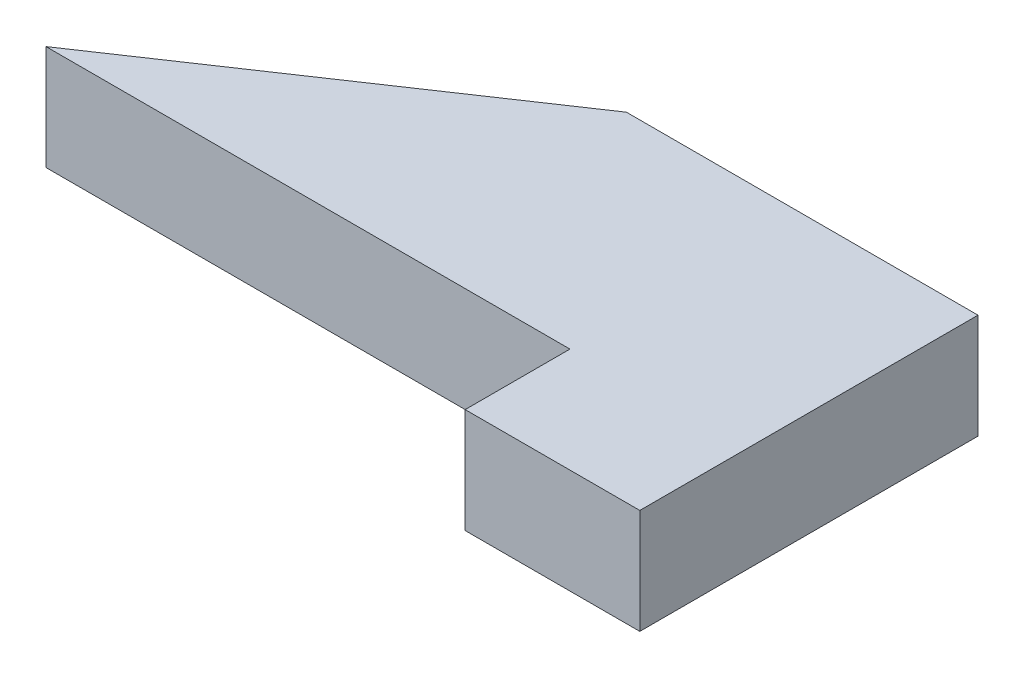
ISO-10303-21;
HEADER;
FILE_DESCRIPTION(('STEP AP214'),'2;1');
FILE_NAME('part.step','',(''),(''),'','','');
FILE_SCHEMA(('AUTOMOTIVE_DESIGN { 1 0 10303 214 1 1 1 1 }'));
ENDSEC;
DATA;
#1=APPLICATION_CONTEXT('core data for automotive mechanical design processes');
#2=APPLICATION_PROTOCOL_DEFINITION('international standard','automotive_design',2000,#1);
#3=PRODUCT_CONTEXT('',#1,'mechanical');
#4=PRODUCT('Part','Part','',(#3));
#5=PRODUCT_RELATED_PRODUCT_CATEGORY('part','',(#4));
#6=PRODUCT_DEFINITION_FORMATION('','',#4);
#7=PRODUCT_DEFINITION_CONTEXT('part definition',#1,'design');
#8=PRODUCT_DEFINITION('design','',#6,#7);
#9=PRODUCT_DEFINITION_SHAPE('','',#8);
#10=(LENGTH_UNIT() NAMED_UNIT(*) SI_UNIT(.MILLI.,.METRE.));
#11=(NAMED_UNIT(*) PLANE_ANGLE_UNIT() SI_UNIT($,.RADIAN.));
#12=(NAMED_UNIT(*) SI_UNIT($,.STERADIAN.) SOLID_ANGLE_UNIT());
#13=UNCERTAINTY_MEASURE_WITH_UNIT(LENGTH_MEASURE(1.E-05),#10,'distance_accuracy_value','');
#14=(GEOMETRIC_REPRESENTATION_CONTEXT(3) GLOBAL_UNCERTAINTY_ASSIGNED_CONTEXT((#13)) GLOBAL_UNIT_ASSIGNED_CONTEXT((#10,
#11,#12)) REPRESENTATION_CONTEXT('',''));
#15=CARTESIAN_POINT('',(0.,0.,0.));
#16=DIRECTION('',(0.,0.,1.));
#17=DIRECTION('',(1.,0.,0.));
#18=AXIS2_PLACEMENT_3D('',#15,#16,#17);
#19=CARTESIAN_POINT('',(-5.,3.,-3.));
#20=DIRECTION('',(0.,0.,1.));
#21=DIRECTION('',(1.,0.,0.));
#22=AXIS2_PLACEMENT_3D('',#19,#20,#21);
#23=PLANE('',#22);
#24=DIRECTION('',(-1.,0.,0.));
#25=VECTOR('',#24,1.);
#26=CARTESIAN_POINT('',(-5.,0.,-3.));
#27=LINE('',#26,#25);
#28=CARTESIAN_POINT('',(-5.,0.,-3.));
#29=VERTEX_POINT('',#28);
#30=CARTESIAN_POINT('',(-20.,0.,-3.));
#31=VERTEX_POINT('',#30);
#32=EDGE_CURVE('E116',#29,#31,#27,.T.);
#33=ORIENTED_EDGE('',*,*,#32,.F.);
#34=DIRECTION('',(0.,-1.,0.));
#35=VECTOR('',#34,1.);
#36=CARTESIAN_POINT('',(-5.,3.,-3.));
#37=LINE('',#36,#35);
#38=CARTESIAN_POINT('',(-5.,3.,-3.));
#39=VERTEX_POINT('',#38);
#40=EDGE_CURVE('E11',#39,#29,#37,.T.);
#41=ORIENTED_EDGE('',*,*,#40,.F.);
#42=DIRECTION('',(-1.,0.,0.));
#43=VECTOR('',#42,1.);
#44=CARTESIAN_POINT('',(-5.,3.,-3.));
#45=LINE('',#44,#43);
#46=CARTESIAN_POINT('',(-20.,3.,-3.));
#47=VERTEX_POINT('',#46);
#48=EDGE_CURVE('E130',#39,#47,#45,.T.);
#49=ORIENTED_EDGE('',*,*,#48,.T.);
#50=DIRECTION('',(0.,-1.,0.));
#51=VECTOR('',#50,1.);
#52=CARTESIAN_POINT('',(-20.,3.,-3.));
#53=LINE('',#52,#51);
#54=EDGE_CURVE('E36',#47,#31,#53,.T.);
#55=ORIENTED_EDGE('',*,*,#54,.T.);
#56=EDGE_LOOP('',(#33,#41,#49,#55));
#57=FACE_BOUND('',#56,.T.);
#58=ADVANCED_FACE('F33',(#57),#23,.T.);
#59=CARTESIAN_POINT('',(-5.,3.,0.));
#60=DIRECTION('',(-1.,0.,0.));
#61=DIRECTION('',(0.,0.,1.));
#62=AXIS2_PLACEMENT_3D('',#59,#60,#61);
#63=PLANE('',#62);
#64=DIRECTION('',(0.,0.,-1.));
#65=VECTOR('',#64,1.);
#66=CARTESIAN_POINT('',(-5.,0.,0.));
#67=LINE('',#66,#65);
#68=CARTESIAN_POINT('',(-5.,0.,0.));
#69=VERTEX_POINT('',#68);
#70=EDGE_CURVE('E128',#69,#29,#67,.T.);
#71=ORIENTED_EDGE('',*,*,#70,.F.);
#72=DIRECTION('',(0.,-1.,0.));
#73=VECTOR('',#72,1.);
#74=CARTESIAN_POINT('',(-5.,3.,0.));
#75=LINE('',#74,#73);
#76=CARTESIAN_POINT('',(-5.,3.,0.));
#77=VERTEX_POINT('',#76);
#78=EDGE_CURVE('E42',#77,#69,#75,.T.);
#79=ORIENTED_EDGE('',*,*,#78,.F.);
#80=DIRECTION('',(0.,0.,-1.));
#81=VECTOR('',#80,1.);
#82=CARTESIAN_POINT('',(-5.,3.,0.));
#83=LINE('',#82,#81);
#84=EDGE_CURVE('E111',#77,#39,#83,.T.);
#85=ORIENTED_EDGE('',*,*,#84,.T.);
#86=ORIENTED_EDGE('',*,*,#40,.T.);
#87=EDGE_LOOP('',(#71,#79,#85,#86));
#88=FACE_BOUND('',#87,.T.);
#89=ADVANCED_FACE('F138',(#88),#63,.T.);
#90=CARTESIAN_POINT('',(0.,3.,0.));
#91=DIRECTION('',(0.,0.,1.));
#92=DIRECTION('',(1.,0.,0.));
#93=AXIS2_PLACEMENT_3D('',#90,#91,#92);
#94=PLANE('',#93);
#95=DIRECTION('',(-1.,0.,0.));
#96=VECTOR('',#95,1.);
#97=CARTESIAN_POINT('',(0.,0.,0.));
#98=LINE('',#97,#96);
#99=CARTESIAN_POINT('',(0.,0.,0.));
#100=VERTEX_POINT('',#99);
#101=EDGE_CURVE('E108',#100,#69,#98,.T.);
#102=ORIENTED_EDGE('',*,*,#101,.F.);
#103=DIRECTION('',(0.,-1.,0.));
#104=VECTOR('',#103,1.);
#105=CARTESIAN_POINT('',(0.,3.,0.));
#106=LINE('',#105,#104);
#107=CARTESIAN_POINT('',(0.,3.,0.));
#108=VERTEX_POINT('',#107);
#109=EDGE_CURVE('E95',#108,#100,#106,.T.);
#110=ORIENTED_EDGE('',*,*,#109,.F.);
#111=DIRECTION('',(-1.,0.,0.));
#112=VECTOR('',#111,1.);
#113=CARTESIAN_POINT('',(0.,3.,0.));
#114=LINE('',#113,#112);
#115=EDGE_CURVE('E103',#108,#77,#114,.T.);
#116=ORIENTED_EDGE('',*,*,#115,.T.);
#117=ORIENTED_EDGE('',*,*,#78,.T.);
#118=EDGE_LOOP('',(#102,#110,#116,#117));
#119=FACE_BOUND('',#118,.T.);
#120=ADVANCED_FACE('F106',(#119),#94,.T.);
#121=CARTESIAN_POINT('',(0.,3.,0.));
#122=DIRECTION('',(-1.,0.,0.));
#123=DIRECTION('',(0.,0.,1.));
#124=AXIS2_PLACEMENT_3D('',#121,#122,#123);
#125=PLANE('',#124);
#126=DIRECTION('',(0.,0.,-1.));
#127=VECTOR('',#126,1.);
#128=CARTESIAN_POINT('',(0.,0.,0.));
#129=LINE('',#128,#127);
#130=CARTESIAN_POINT('',(0.,0.,-9.6820981422111));
#131=VERTEX_POINT('',#130);
#132=EDGE_CURVE('E125',#100,#131,#129,.T.);
#133=ORIENTED_EDGE('',*,*,#132,.T.);
#134=DIRECTION('',(0.,-1.,0.));
#135=VECTOR('',#134,1.);
#136=CARTESIAN_POINT('',(0.,3.,-9.6820981422111));
#137=LINE('',#136,#135);
#138=CARTESIAN_POINT('',(0.,3.,-9.6820981422111));
#139=VERTEX_POINT('',#138);
#140=EDGE_CURVE('E98',#139,#131,#137,.T.);
#141=ORIENTED_EDGE('',*,*,#140,.F.);
#142=DIRECTION('',(0.,0.,-1.));
#143=VECTOR('',#142,1.);
#144=CARTESIAN_POINT('',(0.,3.,-3.));
#145=LINE('',#144,#143);
#146=EDGE_CURVE('E92',#108,#139,#145,.T.);
#147=ORIENTED_EDGE('',*,*,#146,.F.);
#148=ORIENTED_EDGE('',*,*,#109,.T.);
#149=EDGE_LOOP('',(#133,#141,#147,#148));
#150=FACE_BOUND('',#149,.T.);
#151=ADVANCED_FACE('F94',(#150),#125,.F.);
#152=CARTESIAN_POINT('',(-10.0657879679471,3.,-9.6820981422111));
#153=DIRECTION('',(0.,0.,-1.));
#154=DIRECTION('',(-1.,0.,0.));
#155=AXIS2_PLACEMENT_3D('',#152,#153,#154);
#156=PLANE('',#155);
#157=DIRECTION('',(1.,0.,0.));
#158=VECTOR('',#157,1.);
#159=CARTESIAN_POINT('',(-10.0657879679471,0.,-9.6820981422111));
#160=LINE('',#159,#158);
#161=CARTESIAN_POINT('',(-10.0657879679471,0.,-9.6820981422111));
#162=VERTEX_POINT('',#161);
#163=EDGE_CURVE('E122',#162,#131,#160,.T.);
#164=ORIENTED_EDGE('',*,*,#163,.F.);
#165=DIRECTION('',(0.,-1.,0.));
#166=VECTOR('',#165,1.);
#167=CARTESIAN_POINT('',(-10.0657879679471,3.,-9.6820981422111));
#168=LINE('',#167,#166);
#169=CARTESIAN_POINT('',(-10.0657879679471,3.,-9.6820981422111));
#170=VERTEX_POINT('',#169);
#171=EDGE_CURVE('E133',#170,#162,#168,.T.);
#172=ORIENTED_EDGE('',*,*,#171,.F.);
#173=DIRECTION('',(1.,0.,0.));
#174=VECTOR('',#173,1.);
#175=CARTESIAN_POINT('',(-10.0657879679471,3.,-9.6820981422111));
#176=LINE('',#175,#174);
#177=EDGE_CURVE('E104',#170,#139,#176,.T.);
#178=ORIENTED_EDGE('',*,*,#177,.T.);
#179=ORIENTED_EDGE('',*,*,#140,.T.);
#180=EDGE_LOOP('',(#164,#172,#178,#179));
#181=FACE_BOUND('',#180,.T.);
#182=ADVANCED_FACE('F151',(#181),#156,.T.);
#183=CARTESIAN_POINT('',(-20.,3.,-3.));
#184=DIRECTION('',(-0.558123948905455,0.,-0.829757589696039));
#185=DIRECTION('',(-0.829757589696039,0.,0.558123948905456));
#186=AXIS2_PLACEMENT_3D('',#183,#184,#185);
#187=PLANE('',#186);
#188=DIRECTION('',(0.829757589696039,0.,-0.558123948905456));
#189=VECTOR('',#188,1.);
#190=CARTESIAN_POINT('',(-20.,0.,-3.));
#191=LINE('',#190,#189);
#192=EDGE_CURVE('E119',#31,#162,#191,.T.);
#193=ORIENTED_EDGE('',*,*,#192,.F.);
#194=ORIENTED_EDGE('',*,*,#54,.F.);
#195=DIRECTION('',(0.829757589696039,0.,-0.558123948905456));
#196=VECTOR('',#195,1.);
#197=CARTESIAN_POINT('',(-20.,3.,-3.));
#198=LINE('',#197,#196);
#199=EDGE_CURVE('E206',#47,#170,#198,.T.);
#200=ORIENTED_EDGE('',*,*,#199,.T.);
#201=ORIENTED_EDGE('',*,*,#171,.T.);
#202=EDGE_LOOP('',(#193,#194,#200,#201));
#203=FACE_BOUND('',#202,.T.);
#204=ADVANCED_FACE('F135',(#203),#187,.T.);
#205=CARTESIAN_POINT('',(0.,3.,0.));
#206=DIRECTION('',(0.,-1.,0.));
#207=DIRECTION('',(0.,0.,-1.));
#208=AXIS2_PLACEMENT_3D('',#205,#206,#207);
#209=PLANE('',#208);
#210=ORIENTED_EDGE('',*,*,#48,.F.);
#211=ORIENTED_EDGE('',*,*,#84,.F.);
#212=ORIENTED_EDGE('',*,*,#115,.F.);
#213=ORIENTED_EDGE('',*,*,#146,.T.);
#214=ORIENTED_EDGE('',*,*,#177,.F.);
#215=ORIENTED_EDGE('',*,*,#199,.F.);
#216=EDGE_LOOP('',(#210,#211,#212,#213,#214,#215));
#217=FACE_BOUND('',#216,.T.);
#218=ADVANCED_FACE('F110',(#217),#209,.F.);
#219=CARTESIAN_POINT('',(0.,0.,0.));
#220=DIRECTION('',(0.,-1.,0.));
#221=DIRECTION('',(0.,0.,-1.));
#222=AXIS2_PLACEMENT_3D('',#219,#220,#221);
#223=PLANE('',#222);
#224=ORIENTED_EDGE('',*,*,#32,.T.);
#225=ORIENTED_EDGE('',*,*,#192,.T.);
#226=ORIENTED_EDGE('',*,*,#163,.T.);
#227=ORIENTED_EDGE('',*,*,#132,.F.);
#228=ORIENTED_EDGE('',*,*,#101,.T.);
#229=ORIENTED_EDGE('',*,*,#70,.T.);
#230=EDGE_LOOP('',(#224,#225,#226,#227,#228,#229));
#231=FACE_BOUND('',#230,.T.);
#232=ADVANCED_FACE('F137',(#231),#223,.T.);
#233=CLOSED_SHELL('',(#58,#89,#120,#151,#182,#204,#218,#232));
#234=MANIFOLD_SOLID_BREP('B2',#233);
#235=ADVANCED_BREP_SHAPE_REPRESENTATION('',(#18,#234),#14);
#236=SHAPE_DEFINITION_REPRESENTATION(#9,#235);
ENDSEC;
END-ISO-10303-21;
